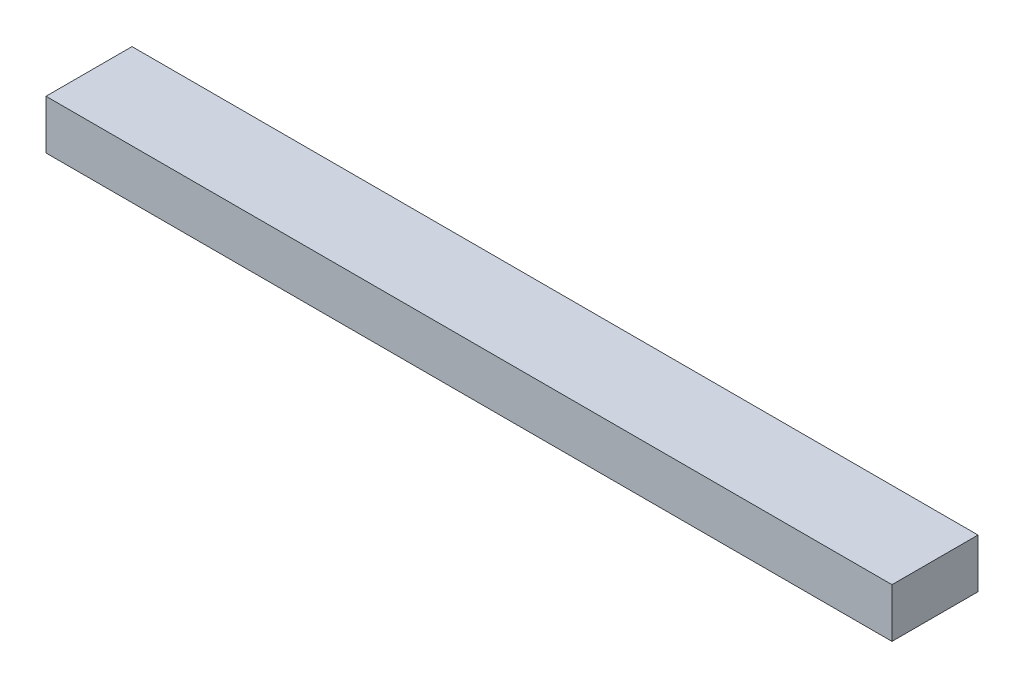
ISO-10303-21;
HEADER;
FILE_DESCRIPTION(('STEP AP214'),'2;1');
FILE_NAME('part.step','',(''),(''),'','','');
FILE_SCHEMA(('AUTOMOTIVE_DESIGN { 1 0 10303 214 1 1 1 1 }'));
ENDSEC;
DATA;
#1=APPLICATION_CONTEXT('core data for automotive mechanical design processes');
#2=APPLICATION_PROTOCOL_DEFINITION('international standard','automotive_design',2000,#1);
#3=PRODUCT_CONTEXT('',#1,'mechanical');
#4=PRODUCT('Part','Part','',(#3));
#5=PRODUCT_RELATED_PRODUCT_CATEGORY('part','',(#4));
#6=PRODUCT_DEFINITION_FORMATION('','',#4);
#7=PRODUCT_DEFINITION_CONTEXT('part definition',#1,'design');
#8=PRODUCT_DEFINITION('design','',#6,#7);
#9=PRODUCT_DEFINITION_SHAPE('','',#8);
#10=(LENGTH_UNIT() NAMED_UNIT(*) SI_UNIT(.MILLI.,.METRE.));
#11=(NAMED_UNIT(*) PLANE_ANGLE_UNIT() SI_UNIT($,.RADIAN.));
#12=(NAMED_UNIT(*) SI_UNIT($,.STERADIAN.) SOLID_ANGLE_UNIT());
#13=UNCERTAINTY_MEASURE_WITH_UNIT(LENGTH_MEASURE(1.E-05),#10,'distance_accuracy_value','');
#14=(GEOMETRIC_REPRESENTATION_CONTEXT(3) GLOBAL_UNCERTAINTY_ASSIGNED_CONTEXT((#13)) GLOBAL_UNIT_ASSIGNED_CONTEXT((#10,
#11,#12)) REPRESENTATION_CONTEXT('',''));
#15=CARTESIAN_POINT('',(0.,0.,0.));
#16=DIRECTION('',(0.,0.,1.));
#17=DIRECTION('',(1.,0.,0.));
#18=AXIS2_PLACEMENT_3D('',#15,#16,#17);
#19=CARTESIAN_POINT('',(437.1975,25.4,44.45));
#20=DIRECTION('',(-1.,0.,0.));
#21=DIRECTION('',(0.,0.,1.));
#22=AXIS2_PLACEMENT_3D('',#19,#20,#21);
#23=PLANE('',#22);
#24=DIRECTION('',(0.,0.,-1.));
#25=VECTOR('',#24,1.);
#26=CARTESIAN_POINT('',(437.1975,-25.4,44.45));
#27=LINE('',#26,#25);
#28=CARTESIAN_POINT('',(437.1975,-25.4,44.45));
#29=VERTEX_POINT('',#28);
#30=CARTESIAN_POINT('',(437.1975,-25.4,-44.45));
#31=VERTEX_POINT('',#30);
#32=EDGE_CURVE('E111',#29,#31,#27,.T.);
#33=ORIENTED_EDGE('',*,*,#32,.T.);
#34=DIRECTION('',(0.,-1.,0.));
#35=VECTOR('',#34,1.);
#36=CARTESIAN_POINT('',(437.1975,25.4,-44.45));
#37=LINE('',#36,#35);
#38=CARTESIAN_POINT('',(437.1975,25.4,-44.45));
#39=VERTEX_POINT('',#38);
#40=EDGE_CURVE('E11',#39,#31,#37,.T.);
#41=ORIENTED_EDGE('',*,*,#40,.F.);
#42=DIRECTION('',(0.,0.,-1.));
#43=VECTOR('',#42,1.);
#44=CARTESIAN_POINT('',(437.1975,25.4,44.45));
#45=LINE('',#44,#43);
#46=CARTESIAN_POINT('',(437.1975,25.4,44.45));
#47=VERTEX_POINT('',#46);
#48=EDGE_CURVE('E95',#47,#39,#45,.T.);
#49=ORIENTED_EDGE('',*,*,#48,.F.);
#50=DIRECTION('',(0.,-1.,0.));
#51=VECTOR('',#50,1.);
#52=CARTESIAN_POINT('',(437.1975,25.4,44.45));
#53=LINE('',#52,#51);
#54=EDGE_CURVE('E107',#47,#29,#53,.T.);
#55=ORIENTED_EDGE('',*,*,#54,.T.);
#56=EDGE_LOOP('',(#33,#41,#49,#55));
#57=FACE_BOUND('',#56,.T.);
#58=ADVANCED_FACE('F43',(#57),#23,.F.);
#59=CARTESIAN_POINT('',(-437.1975,25.4,-44.45));
#60=DIRECTION('',(0.,0.,1.));
#61=DIRECTION('',(1.,0.,0.));
#62=AXIS2_PLACEMENT_3D('',#59,#60,#61);
#63=PLANE('',#62);
#64=DIRECTION('',(-1.,0.,0.));
#65=VECTOR('',#64,1.);
#66=CARTESIAN_POINT('',(-437.1975,-25.4,-44.45));
#67=LINE('',#66,#65);
#68=CARTESIAN_POINT('',(-437.1975,-25.4,-44.45));
#69=VERTEX_POINT('',#68);
#70=EDGE_CURVE('E100',#31,#69,#67,.T.);
#71=ORIENTED_EDGE('',*,*,#70,.T.);
#72=DIRECTION('',(0.,-1.,0.));
#73=VECTOR('',#72,1.);
#74=CARTESIAN_POINT('',(-437.1975,25.4,-44.45));
#75=LINE('',#74,#73);
#76=CARTESIAN_POINT('',(-437.1975,25.4,-44.45));
#77=VERTEX_POINT('',#76);
#78=EDGE_CURVE('E52',#77,#69,#75,.T.);
#79=ORIENTED_EDGE('',*,*,#78,.F.);
#80=DIRECTION('',(-1.,0.,0.));
#81=VECTOR('',#80,1.);
#82=CARTESIAN_POINT('',(-437.1975,25.4,-44.45));
#83=LINE('',#82,#81);
#84=EDGE_CURVE('E90',#39,#77,#83,.T.);
#85=ORIENTED_EDGE('',*,*,#84,.F.);
#86=ORIENTED_EDGE('',*,*,#40,.T.);
#87=EDGE_LOOP('',(#71,#79,#85,#86));
#88=FACE_BOUND('',#87,.T.);
#89=ADVANCED_FACE('F99',(#88),#63,.F.);
#90=CARTESIAN_POINT('',(-437.1975,25.4,44.45));
#91=DIRECTION('',(1.,0.,0.));
#92=DIRECTION('',(0.,0.,-1.));
#93=AXIS2_PLACEMENT_3D('',#90,#91,#92);
#94=PLANE('',#93);
#95=DIRECTION('',(0.,0.,1.));
#96=VECTOR('',#95,1.);
#97=CARTESIAN_POINT('',(-437.1975,-25.4,44.45));
#98=LINE('',#97,#96);
#99=CARTESIAN_POINT('',(-437.1975,-25.4,44.45));
#100=VERTEX_POINT('',#99);
#101=EDGE_CURVE('E77',#69,#100,#98,.T.);
#102=ORIENTED_EDGE('',*,*,#101,.T.);
#103=DIRECTION('',(0.,-1.,0.));
#104=VECTOR('',#103,1.);
#105=CARTESIAN_POINT('',(-437.1975,25.4,44.45));
#106=LINE('',#105,#104);
#107=CARTESIAN_POINT('',(-437.1975,25.4,44.45));
#108=VERTEX_POINT('',#107);
#109=EDGE_CURVE('E102',#108,#100,#106,.T.);
#110=ORIENTED_EDGE('',*,*,#109,.F.);
#111=DIRECTION('',(0.,0.,1.));
#112=VECTOR('',#111,1.);
#113=CARTESIAN_POINT('',(-437.1975,25.4,44.45));
#114=LINE('',#113,#112);
#115=EDGE_CURVE('E93',#77,#108,#114,.T.);
#116=ORIENTED_EDGE('',*,*,#115,.F.);
#117=ORIENTED_EDGE('',*,*,#78,.T.);
#118=EDGE_LOOP('',(#102,#110,#116,#117));
#119=FACE_BOUND('',#118,.T.);
#120=ADVANCED_FACE('F103',(#119),#94,.F.);
#121=CARTESIAN_POINT('',(-437.1975,25.4,44.45));
#122=DIRECTION('',(0.,0.,-1.));
#123=DIRECTION('',(-1.,0.,0.));
#124=AXIS2_PLACEMENT_3D('',#121,#122,#123);
#125=PLANE('',#124);
#126=DIRECTION('',(1.,0.,0.));
#127=VECTOR('',#126,1.);
#128=CARTESIAN_POINT('',(-437.1975,-25.4,44.45));
#129=LINE('',#128,#127);
#130=EDGE_CURVE('E83',#100,#29,#129,.T.);
#131=ORIENTED_EDGE('',*,*,#130,.T.);
#132=ORIENTED_EDGE('',*,*,#54,.F.);
#133=DIRECTION('',(1.,0.,0.));
#134=VECTOR('',#133,1.);
#135=CARTESIAN_POINT('',(-437.1975,25.4,44.45));
#136=LINE('',#135,#134);
#137=EDGE_CURVE('E60',#108,#47,#136,.T.);
#138=ORIENTED_EDGE('',*,*,#137,.F.);
#139=ORIENTED_EDGE('',*,*,#109,.T.);
#140=EDGE_LOOP('',(#131,#132,#138,#139));
#141=FACE_BOUND('',#140,.T.);
#142=ADVANCED_FACE('F124',(#141),#125,.F.);
#143=CARTESIAN_POINT('',(0.,25.4,0.));
#144=DIRECTION('',(0.,-1.,0.));
#145=DIRECTION('',(0.,0.,-1.));
#146=AXIS2_PLACEMENT_3D('',#143,#144,#145);
#147=PLANE('',#146);
#148=ORIENTED_EDGE('',*,*,#48,.T.);
#149=ORIENTED_EDGE('',*,*,#84,.T.);
#150=ORIENTED_EDGE('',*,*,#115,.T.);
#151=ORIENTED_EDGE('',*,*,#137,.T.);
#152=EDGE_LOOP('',(#148,#149,#150,#151));
#153=FACE_BOUND('',#152,.T.);
#154=ADVANCED_FACE('F91',(#153),#147,.F.);
#155=CARTESIAN_POINT('',(0.,-25.4,0.));
#156=DIRECTION('',(0.,-1.,0.));
#157=DIRECTION('',(0.,0.,-1.));
#158=AXIS2_PLACEMENT_3D('',#155,#156,#157);
#159=PLANE('',#158);
#160=ORIENTED_EDGE('',*,*,#32,.F.);
#161=ORIENTED_EDGE('',*,*,#130,.F.);
#162=ORIENTED_EDGE('',*,*,#101,.F.);
#163=ORIENTED_EDGE('',*,*,#70,.F.);
#164=EDGE_LOOP('',(#160,#161,#162,#163));
#165=FACE_BOUND('',#164,.T.);
#166=ADVANCED_FACE('F127',(#165),#159,.T.);
#167=CLOSED_SHELL('',(#58,#89,#120,#142,#154,#166));
#168=MANIFOLD_SOLID_BREP('B2',#167);
#169=ADVANCED_BREP_SHAPE_REPRESENTATION('',(#18,#168),#14);
#170=SHAPE_DEFINITION_REPRESENTATION(#9,#169);
ENDSEC;
END-ISO-10303-21;
